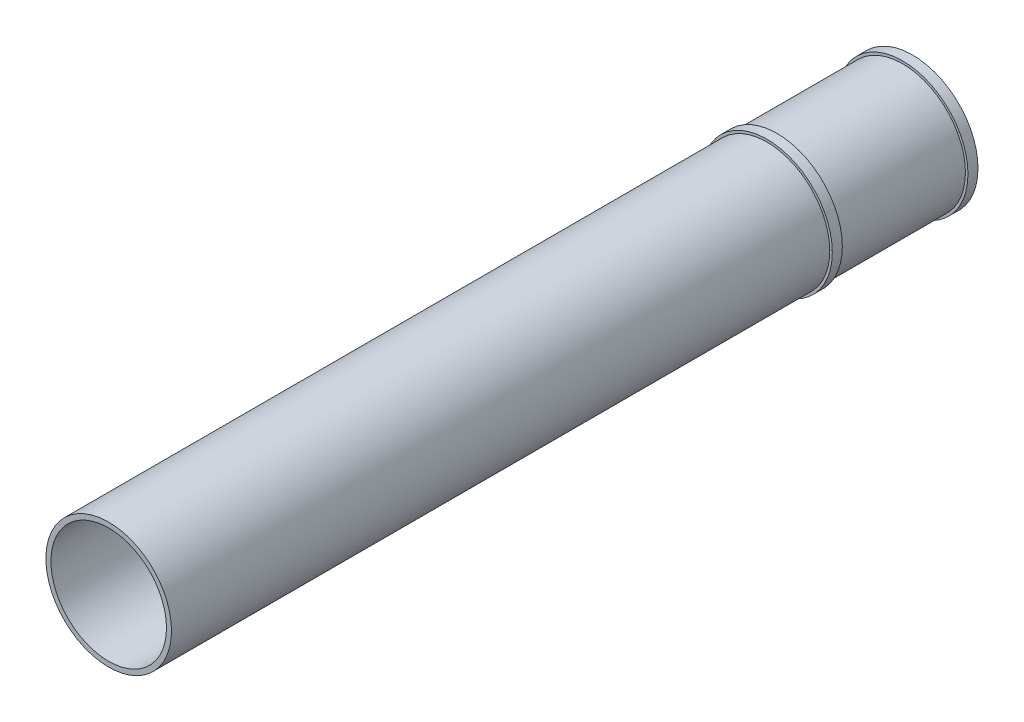
ISO-10303-21;
HEADER;
FILE_DESCRIPTION(('STEP AP214'),'2;1');
FILE_NAME('part.step','',(''),(''),'','','');
FILE_SCHEMA(('AUTOMOTIVE_DESIGN { 1 0 10303 214 1 1 1 1 }'));
ENDSEC;
DATA;
#1=APPLICATION_CONTEXT('core data for automotive mechanical design processes');
#2=APPLICATION_PROTOCOL_DEFINITION('international standard','automotive_design',2000,#1);
#3=PRODUCT_CONTEXT('',#1,'mechanical');
#4=PRODUCT('Part','Part','',(#3));
#5=PRODUCT_RELATED_PRODUCT_CATEGORY('part','',(#4));
#6=PRODUCT_DEFINITION_FORMATION('','',#4);
#7=PRODUCT_DEFINITION_CONTEXT('part definition',#1,'design');
#8=PRODUCT_DEFINITION('design','',#6,#7);
#9=PRODUCT_DEFINITION_SHAPE('','',#8);
#10=(LENGTH_UNIT() NAMED_UNIT(*) SI_UNIT(.MILLI.,.METRE.));
#11=(NAMED_UNIT(*) PLANE_ANGLE_UNIT() SI_UNIT($,.RADIAN.));
#12=(NAMED_UNIT(*) SI_UNIT($,.STERADIAN.) SOLID_ANGLE_UNIT());
#13=UNCERTAINTY_MEASURE_WITH_UNIT(LENGTH_MEASURE(1.E-05),#10,'distance_accuracy_value','');
#14=(GEOMETRIC_REPRESENTATION_CONTEXT(3) GLOBAL_UNCERTAINTY_ASSIGNED_CONTEXT((#13)) GLOBAL_UNIT_ASSIGNED_CONTEXT((#10,
#11,#12)) REPRESENTATION_CONTEXT('',''));
#15=CARTESIAN_POINT('',(0.,0.,0.));
#16=DIRECTION('',(0.,0.,1.));
#17=DIRECTION('',(1.,0.,0.));
#18=AXIS2_PLACEMENT_3D('',#15,#16,#17);
#19=CARTESIAN_POINT('',(0.,0.,320.));
#20=DIRECTION('',(0.,0.,-1.));
#21=DIRECTION('',(-1.,0.,0.));
#22=AXIS2_PLACEMENT_3D('',#19,#20,#21);
#23=CYLINDRICAL_SURFACE('',#22,25.);
#24=CARTESIAN_POINT('',(0.,0.,4.));
#25=DIRECTION('',(0.,0.,1.));
#26=DIRECTION('',(1.,0.,0.));
#27=AXIS2_PLACEMENT_3D('',#24,#25,#26);
#28=CIRCLE('',#27,25.);
#29=CARTESIAN_POINT('',(25.,0.,4.));
#30=VERTEX_POINT('',#29);
#31=EDGE_CURVE('E84',#30,#30,#28,.T.);
#32=ORIENTED_EDGE('',*,*,#31,.T.);
#33=EDGE_LOOP('',(#32));
#34=FACE_BOUND('',#33,.T.);
#35=CARTESIAN_POINT('',(0.,0.,54.));
#36=DIRECTION('',(0.,0.,1.));
#37=DIRECTION('',(1.,0.,0.));
#38=AXIS2_PLACEMENT_3D('',#35,#36,#37);
#39=CIRCLE('',#38,25.);
#40=CARTESIAN_POINT('',(25.,0.,54.));
#41=VERTEX_POINT('',#40);
#42=EDGE_CURVE('E10',#41,#41,#39,.T.);
#43=ORIENTED_EDGE('',*,*,#42,.F.);
#44=EDGE_LOOP('',(#43));
#45=FACE_BOUND('',#44,.T.);
#46=ADVANCED_FACE('F39',(#34,#45),#23,.T.);
#47=CARTESIAN_POINT('',(0.,0.,320.));
#48=DIRECTION('',(0.,0.,-1.));
#49=DIRECTION('',(-1.,0.,0.));
#50=AXIS2_PLACEMENT_3D('',#47,#48,#49);
#51=CYLINDRICAL_SURFACE('',#50,23.);
#52=CARTESIAN_POINT('',(0.,0.,320.));
#53=DIRECTION('',(0.,0.,1.));
#54=DIRECTION('',(1.,0.,0.));
#55=AXIS2_PLACEMENT_3D('',#52,#53,#54);
#56=CIRCLE('',#55,23.);
#57=CARTESIAN_POINT('',(23.,0.,320.));
#58=VERTEX_POINT('',#57);
#59=EDGE_CURVE('E52',#58,#58,#56,.T.);
#60=ORIENTED_EDGE('',*,*,#59,.T.);
#61=EDGE_LOOP('',(#60));
#62=FACE_BOUND('',#61,.T.);
#63=CARTESIAN_POINT('',(0.,0.,0.));
#64=DIRECTION('',(0.,0.,1.));
#65=DIRECTION('',(1.,0.,0.));
#66=AXIS2_PLACEMENT_3D('',#63,#64,#65);
#67=CIRCLE('',#66,23.);
#68=CARTESIAN_POINT('',(23.,0.,0.));
#69=VERTEX_POINT('',#68);
#70=EDGE_CURVE('E58',#69,#69,#67,.T.);
#71=ORIENTED_EDGE('',*,*,#70,.F.);
#72=EDGE_LOOP('',(#71));
#73=FACE_BOUND('',#72,.T.);
#74=ADVANCED_FACE('F41',(#62,#73),#51,.F.);
#75=CARTESIAN_POINT('',(0.,0.,58.));
#76=DIRECTION('',(0.,0.,1.));
#77=DIRECTION('',(1.,0.,0.));
#78=AXIS2_PLACEMENT_3D('',#75,#76,#77);
#79=CIRCLE('',#78,25.);
#80=CARTESIAN_POINT('',(25.,0.,58.));
#81=VERTEX_POINT('',#80);
#82=EDGE_CURVE('E68',#81,#81,#79,.T.);
#83=ORIENTED_EDGE('',*,*,#82,.T.);
#84=EDGE_LOOP('',(#83));
#85=FACE_BOUND('',#84,.T.);
#86=CARTESIAN_POINT('',(0.,0.,320.));
#87=DIRECTION('',(0.,0.,1.));
#88=DIRECTION('',(1.,0.,0.));
#89=AXIS2_PLACEMENT_3D('',#86,#87,#88);
#90=CIRCLE('',#89,25.);
#91=CARTESIAN_POINT('',(25.,0.,320.));
#92=VERTEX_POINT('',#91);
#93=EDGE_CURVE('E47',#92,#92,#90,.T.);
#94=ORIENTED_EDGE('',*,*,#93,.F.);
#95=EDGE_LOOP('',(#94));
#96=FACE_BOUND('',#95,.T.);
#97=ADVANCED_FACE('F110',(#85,#96),#23,.T.);
#98=CARTESIAN_POINT('',(0.,0.,320.));
#99=DIRECTION('',(0.,0.,1.));
#100=DIRECTION('',(1.,0.,0.));
#101=AXIS2_PLACEMENT_3D('',#98,#99,#100);
#102=PLANE('',#101);
#103=ORIENTED_EDGE('',*,*,#59,.F.);
#104=EDGE_LOOP('',(#103));
#105=FACE_BOUND('',#104,.T.);
#106=ORIENTED_EDGE('',*,*,#93,.T.);
#107=EDGE_LOOP('',(#106));
#108=FACE_BOUND('',#107,.T.);
#109=ADVANCED_FACE('F101',(#105,#108),#102,.T.);
#110=CARTESIAN_POINT('',(0.,0.,0.));
#111=DIRECTION('',(0.,0.,1.));
#112=DIRECTION('',(1.,0.,0.));
#113=AXIS2_PLACEMENT_3D('',#110,#111,#112);
#114=PLANE('',#113);
#115=ORIENTED_EDGE('',*,*,#70,.T.);
#116=EDGE_LOOP('',(#115));
#117=FACE_BOUND('',#116,.T.);
#118=CARTESIAN_POINT('',(0.,0.,0.));
#119=DIRECTION('',(0.,0.,1.));
#120=DIRECTION('',(1.,0.,0.));
#121=AXIS2_PLACEMENT_3D('',#118,#119,#120);
#122=CIRCLE('',#121,26.);
#123=CARTESIAN_POINT('',(26.,0.,0.));
#124=VERTEX_POINT('',#123);
#125=EDGE_CURVE('E90',#124,#124,#122,.T.);
#126=ORIENTED_EDGE('',*,*,#125,.F.);
#127=EDGE_LOOP('',(#126));
#128=FACE_BOUND('',#127,.T.);
#129=ADVANCED_FACE('F98',(#117,#128),#114,.F.);
#130=CARTESIAN_POINT('',(0.,0.,58.));
#131=DIRECTION('',(0.,0.,-1.));
#132=DIRECTION('',(-1.,0.,0.));
#133=AXIS2_PLACEMENT_3D('',#130,#131,#132);
#134=CYLINDRICAL_SURFACE('',#133,26.);
#135=CARTESIAN_POINT('',(0.,0.,58.));
#136=DIRECTION('',(0.,0.,1.));
#137=DIRECTION('',(1.,0.,0.));
#138=AXIS2_PLACEMENT_3D('',#135,#136,#137);
#139=CIRCLE('',#138,26.);
#140=CARTESIAN_POINT('',(26.,0.,58.));
#141=VERTEX_POINT('',#140);
#142=EDGE_CURVE('E63',#141,#141,#139,.T.);
#143=ORIENTED_EDGE('',*,*,#142,.F.);
#144=EDGE_LOOP('',(#143));
#145=FACE_BOUND('',#144,.T.);
#146=CARTESIAN_POINT('',(0.,0.,54.));
#147=DIRECTION('',(0.,0.,1.));
#148=DIRECTION('',(1.,0.,0.));
#149=AXIS2_PLACEMENT_3D('',#146,#147,#148);
#150=CIRCLE('',#149,26.);
#151=CARTESIAN_POINT('',(26.,0.,54.));
#152=VERTEX_POINT('',#151);
#153=EDGE_CURVE('E74',#152,#152,#150,.T.);
#154=ORIENTED_EDGE('',*,*,#153,.T.);
#155=EDGE_LOOP('',(#154));
#156=FACE_BOUND('',#155,.T.);
#157=ADVANCED_FACE('F100',(#145,#156),#134,.T.);
#158=CARTESIAN_POINT('',(0.,0.,58.));
#159=DIRECTION('',(0.,0.,1.));
#160=DIRECTION('',(1.,0.,0.));
#161=AXIS2_PLACEMENT_3D('',#158,#159,#160);
#162=PLANE('',#161);
#163=ORIENTED_EDGE('',*,*,#82,.F.);
#164=EDGE_LOOP('',(#163));
#165=FACE_BOUND('',#164,.T.);
#166=ORIENTED_EDGE('',*,*,#142,.T.);
#167=EDGE_LOOP('',(#166));
#168=FACE_BOUND('',#167,.T.);
#169=ADVANCED_FACE('F107',(#165,#168),#162,.T.);
#170=CARTESIAN_POINT('',(0.,0.,54.));
#171=DIRECTION('',(0.,0.,1.));
#172=DIRECTION('',(1.,0.,0.));
#173=AXIS2_PLACEMENT_3D('',#170,#171,#172);
#174=PLANE('',#173);
#175=ORIENTED_EDGE('',*,*,#42,.T.);
#176=EDGE_LOOP('',(#175));
#177=FACE_BOUND('',#176,.T.);
#178=ORIENTED_EDGE('',*,*,#153,.F.);
#179=EDGE_LOOP('',(#178));
#180=FACE_BOUND('',#179,.T.);
#181=ADVANCED_FACE('F128',(#177,#180),#174,.F.);
#182=CARTESIAN_POINT('',(0.,0.,4.));
#183=DIRECTION('',(0.,0.,-1.));
#184=DIRECTION('',(-1.,0.,0.));
#185=AXIS2_PLACEMENT_3D('',#182,#183,#184);
#186=CYLINDRICAL_SURFACE('',#185,26.);
#187=CARTESIAN_POINT('',(0.,0.,4.));
#188=DIRECTION('',(0.,0.,1.));
#189=DIRECTION('',(1.,0.,0.));
#190=AXIS2_PLACEMENT_3D('',#187,#188,#189);
#191=CIRCLE('',#190,26.);
#192=CARTESIAN_POINT('',(26.,0.,4.));
#193=VERTEX_POINT('',#192);
#194=EDGE_CURVE('E79',#193,#193,#191,.T.);
#195=ORIENTED_EDGE('',*,*,#194,.F.);
#196=EDGE_LOOP('',(#195));
#197=FACE_BOUND('',#196,.T.);
#198=ORIENTED_EDGE('',*,*,#125,.T.);
#199=EDGE_LOOP('',(#198));
#200=FACE_BOUND('',#199,.T.);
#201=ADVANCED_FACE('F96',(#197,#200),#186,.T.);
#202=CARTESIAN_POINT('',(0.,0.,4.));
#203=DIRECTION('',(0.,0.,1.));
#204=DIRECTION('',(1.,0.,0.));
#205=AXIS2_PLACEMENT_3D('',#202,#203,#204);
#206=PLANE('',#205);
#207=ORIENTED_EDGE('',*,*,#31,.F.);
#208=EDGE_LOOP('',(#207));
#209=FACE_BOUND('',#208,.T.);
#210=ORIENTED_EDGE('',*,*,#194,.T.);
#211=EDGE_LOOP('',(#210));
#212=FACE_BOUND('',#211,.T.);
#213=ADVANCED_FACE('F137',(#209,#212),#206,.T.);
#214=CLOSED_SHELL('',(#46,#74,#97,#109,#129,#157,#169,#181,#201,#213));
#215=MANIFOLD_SOLID_BREP('B2',#214);
#216=ADVANCED_BREP_SHAPE_REPRESENTATION('',(#18,#215),#14);
#217=SHAPE_DEFINITION_REPRESENTATION(#9,#216);
ENDSEC;
END-ISO-10303-21;
